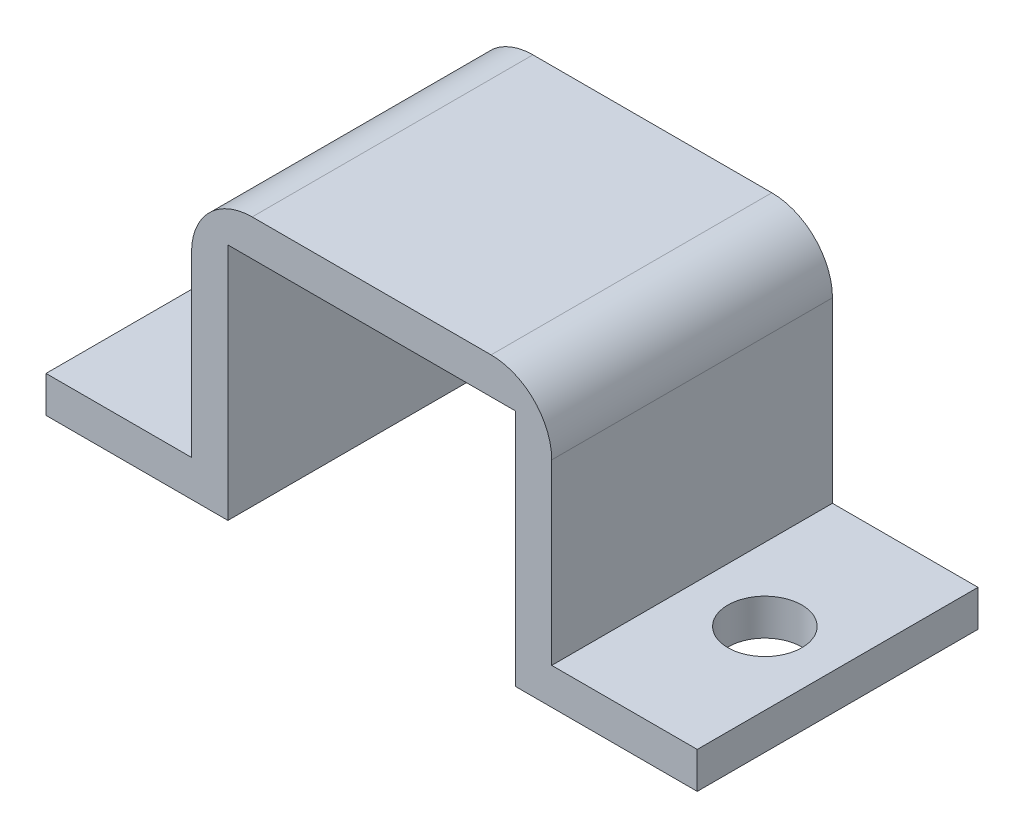
ISO-10303-21;
HEADER;
FILE_DESCRIPTION(('STEP AP214'),'2;1');
FILE_NAME('part.step','',(''),(''),'','','');
FILE_SCHEMA(('AUTOMOTIVE_DESIGN { 1 0 10303 214 1 1 1 1 }'));
ENDSEC;
DATA;
#1=APPLICATION_CONTEXT('core data for automotive mechanical design processes');
#2=APPLICATION_PROTOCOL_DEFINITION('international standard','automotive_design',2000,#1);
#3=PRODUCT_CONTEXT('',#1,'mechanical');
#4=PRODUCT('Part','Part','',(#3));
#5=PRODUCT_RELATED_PRODUCT_CATEGORY('part','',(#4));
#6=PRODUCT_DEFINITION_FORMATION('','',#4);
#7=PRODUCT_DEFINITION_CONTEXT('part definition',#1,'design');
#8=PRODUCT_DEFINITION('design','',#6,#7);
#9=PRODUCT_DEFINITION_SHAPE('','',#8);
#10=(LENGTH_UNIT() NAMED_UNIT(*) SI_UNIT(.MILLI.,.METRE.));
#11=(NAMED_UNIT(*) PLANE_ANGLE_UNIT() SI_UNIT($,.RADIAN.));
#12=(NAMED_UNIT(*) SI_UNIT($,.STERADIAN.) SOLID_ANGLE_UNIT());
#13=UNCERTAINTY_MEASURE_WITH_UNIT(LENGTH_MEASURE(1.E-05),#10,'distance_accuracy_value','');
#14=(GEOMETRIC_REPRESENTATION_CONTEXT(3) GLOBAL_UNCERTAINTY_ASSIGNED_CONTEXT((#13)) GLOBAL_UNIT_ASSIGNED_CONTEXT((#10,
#11,#12)) REPRESENTATION_CONTEXT('',''));
#15=CARTESIAN_POINT('',(0.,0.,0.));
#16=DIRECTION('',(0.,0.,1.));
#17=DIRECTION('',(1.,0.,0.));
#18=AXIS2_PLACEMENT_3D('',#15,#16,#17);
#19=CARTESIAN_POINT('',(0.,1.524,11.7602));
#20=DIRECTION('',(1.,0.,0.));
#21=DIRECTION('',(0.,0.,-1.));
#22=AXIS2_PLACEMENT_3D('',#19,#20,#21);
#23=PLANE('',#22);
#24=DIRECTION('',(0.,-1.,0.));
#25=VECTOR('',#24,1.);
#26=CARTESIAN_POINT('',(0.,1.524,0.));
#27=LINE('',#26,#25);
#28=CARTESIAN_POINT('',(0.,1.524,0.));
#29=VERTEX_POINT('',#28);
#30=CARTESIAN_POINT('',(0.,0.,0.));
#31=VERTEX_POINT('',#30);
#32=EDGE_CURVE('E157',#29,#31,#27,.T.);
#33=ORIENTED_EDGE('',*,*,#32,.T.);
#34=DIRECTION('',(0.,0.,-1.));
#35=VECTOR('',#34,1.);
#36=CARTESIAN_POINT('',(0.,0.,11.7602));
#37=LINE('',#36,#35);
#38=CARTESIAN_POINT('',(0.,0.,11.7602));
#39=VERTEX_POINT('',#38);
#40=EDGE_CURVE('E138',#39,#31,#37,.T.);
#41=ORIENTED_EDGE('',*,*,#40,.F.);
#42=DIRECTION('',(0.,-1.,0.));
#43=VECTOR('',#42,1.);
#44=CARTESIAN_POINT('',(0.,1.524,11.7602));
#45=LINE('',#44,#43);
#46=CARTESIAN_POINT('',(0.,1.524,11.7602));
#47=VERTEX_POINT('',#46);
#48=EDGE_CURVE('E145',#47,#39,#45,.T.);
#49=ORIENTED_EDGE('',*,*,#48,.F.);
#50=DIRECTION('',(0.,0.,-1.));
#51=VECTOR('',#50,1.);
#52=CARTESIAN_POINT('',(0.,1.524,11.7602));
#53=LINE('',#52,#51);
#54=EDGE_CURVE('E194',#47,#29,#53,.T.);
#55=ORIENTED_EDGE('',*,*,#54,.T.);
#56=EDGE_LOOP('',(#33,#41,#49,#55));
#57=FACE_BOUND('',#56,.T.);
#58=ADVANCED_FACE('F33',(#57),#23,.F.);
#59=CARTESIAN_POINT('',(0.,0.,11.7602));
#60=DIRECTION('',(0.,1.,0.));
#61=DIRECTION('',(0.,0.,1.));
#62=AXIS2_PLACEMENT_3D('',#59,#60,#61);
#63=PLANE('',#62);
#64=CARTESIAN_POINT('',(3.048,0.,5.8801));
#65=DIRECTION('',(0.,1.,0.));
#66=DIRECTION('',(0.,0.,1.));
#67=AXIS2_PLACEMENT_3D('',#64,#65,#66);
#68=CIRCLE('',#67,1.55);
#69=CARTESIAN_POINT('',(3.048,0.,7.4301));
#70=VERTEX_POINT('',#69);
#71=EDGE_CURVE('E443',#70,#70,#68,.T.);
#72=ORIENTED_EDGE('',*,*,#71,.T.);
#73=EDGE_LOOP('',(#72));
#74=FACE_BOUND('',#73,.T.);
#75=DIRECTION('',(1.,0.,0.));
#76=VECTOR('',#75,1.);
#77=CARTESIAN_POINT('',(0.,0.,0.));
#78=LINE('',#77,#76);
#79=CARTESIAN_POINT('',(7.62,0.,0.));
#80=VERTEX_POINT('',#79);
#81=EDGE_CURVE('E230',#31,#80,#78,.T.);
#82=ORIENTED_EDGE('',*,*,#81,.T.);
#83=DIRECTION('',(0.,0.,-1.));
#84=VECTOR('',#83,1.);
#85=CARTESIAN_POINT('',(7.62,0.,11.7602));
#86=LINE('',#85,#84);
#87=CARTESIAN_POINT('',(7.62,0.,11.7602));
#88=VERTEX_POINT('',#87);
#89=EDGE_CURVE('E141',#88,#80,#86,.T.);
#90=ORIENTED_EDGE('',*,*,#89,.F.);
#91=DIRECTION('',(1.,0.,0.));
#92=VECTOR('',#91,1.);
#93=CARTESIAN_POINT('',(0.,0.,11.7602));
#94=LINE('',#93,#92);
#95=EDGE_CURVE('E134',#39,#88,#94,.T.);
#96=ORIENTED_EDGE('',*,*,#95,.F.);
#97=ORIENTED_EDGE('',*,*,#40,.T.);
#98=EDGE_LOOP('',(#82,#90,#96,#97));
#99=FACE_BOUND('',#98,.T.);
#100=ADVANCED_FACE('F136',(#74,#99),#63,.F.);
#101=CARTESIAN_POINT('',(7.62,0.,11.7602));
#102=DIRECTION('',(-1.,0.,0.));
#103=DIRECTION('',(0.,0.,1.));
#104=AXIS2_PLACEMENT_3D('',#101,#102,#103);
#105=PLANE('',#104);
#106=DIRECTION('',(0.,1.,0.));
#107=VECTOR('',#106,1.);
#108=CARTESIAN_POINT('',(7.62,0.,0.));
#109=LINE('',#108,#107);
#110=CARTESIAN_POINT('',(7.62,9.9949,0.));
#111=VERTEX_POINT('',#110);
#112=EDGE_CURVE('E224',#80,#111,#109,.T.);
#113=ORIENTED_EDGE('',*,*,#112,.T.);
#114=DIRECTION('',(0.,0.,-1.));
#115=VECTOR('',#114,1.);
#116=CARTESIAN_POINT('',(7.62,9.9949,11.7602));
#117=LINE('',#116,#115);
#118=CARTESIAN_POINT('',(7.62,9.9949,11.7602));
#119=VERTEX_POINT('',#118);
#120=EDGE_CURVE('E163',#119,#111,#117,.T.);
#121=ORIENTED_EDGE('',*,*,#120,.F.);
#122=DIRECTION('',(0.,1.,0.));
#123=VECTOR('',#122,1.);
#124=CARTESIAN_POINT('',(7.62,0.,11.7602));
#125=LINE('',#124,#123);
#126=EDGE_CURVE('E144',#88,#119,#125,.T.);
#127=ORIENTED_EDGE('',*,*,#126,.F.);
#128=ORIENTED_EDGE('',*,*,#89,.T.);
#129=EDGE_LOOP('',(#113,#121,#127,#128));
#130=FACE_BOUND('',#129,.T.);
#131=ADVANCED_FACE('F262',(#130),#105,.F.);
#132=CARTESIAN_POINT('',(7.62,9.9949,11.7602));
#133=DIRECTION('',(0.,1.,0.));
#134=DIRECTION('',(0.,0.,1.));
#135=AXIS2_PLACEMENT_3D('',#132,#133,#134);
#136=PLANE('',#135);
#137=DIRECTION('',(1.,0.,0.));
#138=VECTOR('',#137,1.);
#139=CARTESIAN_POINT('',(7.62,9.9949,0.));
#140=LINE('',#139,#138);
#141=CARTESIAN_POINT('',(19.6596,9.9949,0.));
#142=VERTEX_POINT('',#141);
#143=EDGE_CURVE('E219',#111,#142,#140,.T.);
#144=ORIENTED_EDGE('',*,*,#143,.T.);
#145=DIRECTION('',(0.,0.,-1.));
#146=VECTOR('',#145,1.);
#147=CARTESIAN_POINT('',(19.6596,9.9949,11.7602));
#148=LINE('',#147,#146);
#149=CARTESIAN_POINT('',(19.6596,9.9949,11.7602));
#150=VERTEX_POINT('',#149);
#151=EDGE_CURVE('E210',#150,#142,#148,.T.);
#152=ORIENTED_EDGE('',*,*,#151,.F.);
#153=DIRECTION('',(1.,0.,0.));
#154=VECTOR('',#153,1.);
#155=CARTESIAN_POINT('',(7.62,9.9949,11.7602));
#156=LINE('',#155,#154);
#157=EDGE_CURVE('E220',#119,#150,#156,.T.);
#158=ORIENTED_EDGE('',*,*,#157,.F.);
#159=ORIENTED_EDGE('',*,*,#120,.T.);
#160=EDGE_LOOP('',(#144,#152,#158,#159));
#161=FACE_BOUND('',#160,.T.);
#162=ADVANCED_FACE('F217',(#161),#136,.F.);
#163=CARTESIAN_POINT('',(19.6596,9.9949,11.7602));
#164=DIRECTION('',(1.,0.,0.));
#165=DIRECTION('',(0.,0.,-1.));
#166=AXIS2_PLACEMENT_3D('',#163,#164,#165);
#167=PLANE('',#166);
#168=DIRECTION('',(0.,-1.,0.));
#169=VECTOR('',#168,1.);
#170=CARTESIAN_POINT('',(19.6596,9.9949,0.));
#171=LINE('',#170,#169);
#172=CARTESIAN_POINT('',(19.6596,0.,0.));
#173=VERTEX_POINT('',#172);
#174=EDGE_CURVE('E226',#142,#173,#171,.T.);
#175=ORIENTED_EDGE('',*,*,#174,.T.);
#176=DIRECTION('',(0.,0.,-1.));
#177=VECTOR('',#176,1.);
#178=CARTESIAN_POINT('',(19.6596,0.,11.7602));
#179=LINE('',#178,#177);
#180=CARTESIAN_POINT('',(19.6596,0.,11.7602));
#181=VERTEX_POINT('',#180);
#182=EDGE_CURVE('E207',#181,#173,#179,.T.);
#183=ORIENTED_EDGE('',*,*,#182,.F.);
#184=DIRECTION('',(0.,-1.,0.));
#185=VECTOR('',#184,1.);
#186=CARTESIAN_POINT('',(19.6596,9.9949,11.7602));
#187=LINE('',#186,#185);
#188=EDGE_CURVE('E264',#150,#181,#187,.T.);
#189=ORIENTED_EDGE('',*,*,#188,.F.);
#190=ORIENTED_EDGE('',*,*,#151,.T.);
#191=EDGE_LOOP('',(#175,#183,#189,#190));
#192=FACE_BOUND('',#191,.T.);
#193=ADVANCED_FACE('F286',(#192),#167,.F.);
#194=CARTESIAN_POINT('',(19.6596,0.,11.7602));
#195=DIRECTION('',(0.,1.,0.));
#196=DIRECTION('',(-1.,0.,0.));
#197=AXIS2_PLACEMENT_3D('',#194,#195,#196);
#198=PLANE('',#197);
#199=CARTESIAN_POINT('',(24.2316,0.,5.8801));
#200=DIRECTION('',(0.,1.,0.));
#201=DIRECTION('',(0.,0.,1.));
#202=AXIS2_PLACEMENT_3D('',#199,#200,#201);
#203=CIRCLE('',#202,1.55);
#204=CARTESIAN_POINT('',(24.2316,0.,7.4301));
#205=VERTEX_POINT('',#204);
#206=EDGE_CURVE('E441',#205,#205,#203,.T.);
#207=ORIENTED_EDGE('',*,*,#206,.T.);
#208=EDGE_LOOP('',(#207));
#209=FACE_BOUND('',#208,.T.);
#210=DIRECTION('',(1.,0.,0.));
#211=VECTOR('',#210,1.);
#212=CARTESIAN_POINT('',(19.6596,0.,0.));
#213=LINE('',#212,#211);
#214=CARTESIAN_POINT('',(27.2796,0.,0.));
#215=VERTEX_POINT('',#214);
#216=EDGE_CURVE('E228',#173,#215,#213,.T.);
#217=ORIENTED_EDGE('',*,*,#216,.T.);
#218=DIRECTION('',(0.,0.,-1.));
#219=VECTOR('',#218,1.);
#220=CARTESIAN_POINT('',(27.2796,0.,11.7602));
#221=LINE('',#220,#219);
#222=CARTESIAN_POINT('',(27.2796,0.,11.7602));
#223=VERTEX_POINT('',#222);
#224=EDGE_CURVE('E204',#223,#215,#221,.T.);
#225=ORIENTED_EDGE('',*,*,#224,.F.);
#226=DIRECTION('',(1.,0.,0.));
#227=VECTOR('',#226,1.);
#228=CARTESIAN_POINT('',(19.6596,0.,11.7602));
#229=LINE('',#228,#227);
#230=EDGE_CURVE('E268',#181,#223,#229,.T.);
#231=ORIENTED_EDGE('',*,*,#230,.F.);
#232=ORIENTED_EDGE('',*,*,#182,.T.);
#233=EDGE_LOOP('',(#217,#225,#231,#232));
#234=FACE_BOUND('',#233,.T.);
#235=ADVANCED_FACE('F282',(#209,#234),#198,.F.);
#236=CARTESIAN_POINT('',(27.2796,1.524,11.7602));
#237=DIRECTION('',(-1.,0.,0.));
#238=DIRECTION('',(0.,0.,1.));
#239=AXIS2_PLACEMENT_3D('',#236,#237,#238);
#240=PLANE('',#239);
#241=DIRECTION('',(0.,1.,0.));
#242=VECTOR('',#241,1.);
#243=CARTESIAN_POINT('',(27.2796,1.524,0.));
#244=LINE('',#243,#242);
#245=CARTESIAN_POINT('',(27.2796,1.524,0.));
#246=VERTEX_POINT('',#245);
#247=EDGE_CURVE('E235',#215,#246,#244,.T.);
#248=ORIENTED_EDGE('',*,*,#247,.T.);
#249=DIRECTION('',(0.,0.,-1.));
#250=VECTOR('',#249,1.);
#251=CARTESIAN_POINT('',(27.2796,1.524,11.7602));
#252=LINE('',#251,#250);
#253=CARTESIAN_POINT('',(27.2796,1.524,11.7602));
#254=VERTEX_POINT('',#253);
#255=EDGE_CURVE('E201',#254,#246,#252,.T.);
#256=ORIENTED_EDGE('',*,*,#255,.F.);
#257=DIRECTION('',(0.,1.,0.));
#258=VECTOR('',#257,1.);
#259=CARTESIAN_POINT('',(27.2796,1.524,11.7602));
#260=LINE('',#259,#258);
#261=EDGE_CURVE('E270',#223,#254,#260,.T.);
#262=ORIENTED_EDGE('',*,*,#261,.F.);
#263=ORIENTED_EDGE('',*,*,#224,.T.);
#264=EDGE_LOOP('',(#248,#256,#262,#263));
#265=FACE_BOUND('',#264,.T.);
#266=ADVANCED_FACE('F278',(#265),#240,.F.);
#267=CARTESIAN_POINT('',(21.1836,1.524,11.7602));
#268=DIRECTION('',(0.,-1.,0.));
#269=DIRECTION('',(0.,0.,-1.));
#270=AXIS2_PLACEMENT_3D('',#267,#268,#269);
#271=PLANE('',#270);
#272=CARTESIAN_POINT('',(24.2316,1.524,5.8801));
#273=DIRECTION('',(0.,-1.,0.));
#274=DIRECTION('',(0.,0.,-1.));
#275=AXIS2_PLACEMENT_3D('',#272,#273,#274);
#276=CIRCLE('',#275,1.55);
#277=CARTESIAN_POINT('',(24.2316,1.524,4.3301));
#278=VERTEX_POINT('',#277);
#279=EDGE_CURVE('E438',#278,#278,#276,.T.);
#280=ORIENTED_EDGE('',*,*,#279,.T.);
#281=EDGE_LOOP('',(#280));
#282=FACE_BOUND('',#281,.T.);
#283=DIRECTION('',(-1.,0.,0.));
#284=VECTOR('',#283,1.);
#285=CARTESIAN_POINT('',(21.1836,1.524,0.));
#286=LINE('',#285,#284);
#287=CARTESIAN_POINT('',(21.1836,1.524,0.));
#288=VERTEX_POINT('',#287);
#289=EDGE_CURVE('E237',#246,#288,#286,.T.);
#290=ORIENTED_EDGE('',*,*,#289,.T.);
#291=DIRECTION('',(0.,0.,-1.));
#292=VECTOR('',#291,1.);
#293=CARTESIAN_POINT('',(21.1836,1.524,11.7602));
#294=LINE('',#293,#292);
#295=CARTESIAN_POINT('',(21.1836,1.524,11.7602));
#296=VERTEX_POINT('',#295);
#297=EDGE_CURVE('E198',#296,#288,#294,.T.);
#298=ORIENTED_EDGE('',*,*,#297,.F.);
#299=DIRECTION('',(-1.,0.,0.));
#300=VECTOR('',#299,1.);
#301=CARTESIAN_POINT('',(21.1836,1.524,11.7602));
#302=LINE('',#301,#300);
#303=EDGE_CURVE('E256',#254,#296,#302,.T.);
#304=ORIENTED_EDGE('',*,*,#303,.F.);
#305=ORIENTED_EDGE('',*,*,#255,.T.);
#306=EDGE_LOOP('',(#290,#298,#304,#305));
#307=FACE_BOUND('',#306,.T.);
#308=ADVANCED_FACE('F275',(#282,#307),#271,.F.);
#309=CARTESIAN_POINT('',(21.1836,11.5189,11.7602));
#310=DIRECTION('',(-1.,0.,0.));
#311=DIRECTION('',(0.,0.,1.));
#312=AXIS2_PLACEMENT_3D('',#309,#310,#311);
#313=PLANE('',#312);
#314=DIRECTION('',(0.,1.,0.));
#315=VECTOR('',#314,1.);
#316=CARTESIAN_POINT('',(21.1836,11.5189,0.));
#317=LINE('',#316,#315);
#318=CARTESIAN_POINT('',(21.1836,8.9789,0.));
#319=VERTEX_POINT('',#318);
#320=EDGE_CURVE('E190',#288,#319,#317,.T.);
#321=ORIENTED_EDGE('',*,*,#320,.T.);
#322=DIRECTION('',(0.,0.,-1.));
#323=VECTOR('',#322,1.);
#324=CARTESIAN_POINT('',(21.1836,8.9789,11.7602));
#325=LINE('',#324,#323);
#326=CARTESIAN_POINT('',(21.1836,8.9789,11.7602));
#327=VERTEX_POINT('',#326);
#328=EDGE_CURVE('E168',#319,#327,#325,.F.);
#329=ORIENTED_EDGE('',*,*,#328,.T.);
#330=DIRECTION('',(0.,1.,0.));
#331=VECTOR('',#330,1.);
#332=CARTESIAN_POINT('',(21.1836,11.5189,11.7602));
#333=LINE('',#332,#331);
#334=EDGE_CURVE('E252',#296,#327,#333,.T.);
#335=ORIENTED_EDGE('',*,*,#334,.F.);
#336=ORIENTED_EDGE('',*,*,#297,.T.);
#337=EDGE_LOOP('',(#321,#329,#335,#336));
#338=FACE_BOUND('',#337,.T.);
#339=ADVANCED_FACE('F242',(#338),#313,.F.);
#340=CARTESIAN_POINT('',(6.096,11.5189,11.7602));
#341=DIRECTION('',(0.,-1.,0.));
#342=DIRECTION('',(0.,0.,-1.));
#343=AXIS2_PLACEMENT_3D('',#340,#341,#342);
#344=PLANE('',#343);
#345=DIRECTION('',(-1.,0.,0.));
#346=VECTOR('',#345,1.);
#347=CARTESIAN_POINT('',(6.096,11.5189,0.));
#348=LINE('',#347,#346);
#349=CARTESIAN_POINT('',(18.6436,11.5189,0.));
#350=VERTEX_POINT('',#349);
#351=CARTESIAN_POINT('',(8.636,11.5189,0.));
#352=VERTEX_POINT('',#351);
#353=EDGE_CURVE('E187',#350,#352,#348,.T.);
#354=ORIENTED_EDGE('',*,*,#353,.T.);
#355=DIRECTION('',(0.,0.,-1.));
#356=VECTOR('',#355,1.);
#357=CARTESIAN_POINT('',(8.636,11.5189,11.7602));
#358=LINE('',#357,#356);
#359=CARTESIAN_POINT('',(8.636,11.5189,11.7602));
#360=VERTEX_POINT('',#359);
#361=EDGE_CURVE('E41',#352,#360,#358,.F.);
#362=ORIENTED_EDGE('',*,*,#361,.T.);
#363=DIRECTION('',(-1.,0.,0.));
#364=VECTOR('',#363,1.);
#365=CARTESIAN_POINT('',(6.096,11.5189,11.7602));
#366=LINE('',#365,#364);
#367=CARTESIAN_POINT('',(18.6436,11.5189,11.7602));
#368=VERTEX_POINT('',#367);
#369=EDGE_CURVE('E251',#368,#360,#366,.T.);
#370=ORIENTED_EDGE('',*,*,#369,.F.);
#371=DIRECTION('',(0.,0.,-1.));
#372=VECTOR('',#371,1.);
#373=CARTESIAN_POINT('',(18.6436,11.5189,11.7602));
#374=LINE('',#373,#372);
#375=EDGE_CURVE('E158',#368,#350,#374,.T.);
#376=ORIENTED_EDGE('',*,*,#375,.T.);
#377=EDGE_LOOP('',(#354,#362,#370,#376));
#378=FACE_BOUND('',#377,.T.);
#379=ADVANCED_FACE('F253',(#378),#344,.F.);
#380=CARTESIAN_POINT('',(6.096,1.524,11.7602));
#381=DIRECTION('',(1.,0.,0.));
#382=DIRECTION('',(0.,0.,-1.));
#383=AXIS2_PLACEMENT_3D('',#380,#381,#382);
#384=PLANE('',#383);
#385=DIRECTION('',(0.,-1.,0.));
#386=VECTOR('',#385,1.);
#387=CARTESIAN_POINT('',(6.096,1.524,11.7602));
#388=LINE('',#387,#386);
#389=CARTESIAN_POINT('',(6.096,8.9789,11.7602));
#390=VERTEX_POINT('',#389);
#391=CARTESIAN_POINT('',(6.096,1.524,11.7602));
#392=VERTEX_POINT('',#391);
#393=EDGE_CURVE('E182',#390,#392,#388,.T.);
#394=ORIENTED_EDGE('',*,*,#393,.F.);
#395=DIRECTION('',(0.,0.,-1.));
#396=VECTOR('',#395,1.);
#397=CARTESIAN_POINT('',(6.096,8.9789,11.7602));
#398=LINE('',#397,#396);
#399=CARTESIAN_POINT('',(6.096,8.9789,0.));
#400=VERTEX_POINT('',#399);
#401=EDGE_CURVE('E172',#390,#400,#398,.T.);
#402=ORIENTED_EDGE('',*,*,#401,.T.);
#403=DIRECTION('',(0.,-1.,0.));
#404=VECTOR('',#403,1.);
#405=CARTESIAN_POINT('',(6.096,1.524,0.));
#406=LINE('',#405,#404);
#407=CARTESIAN_POINT('',(6.096,1.524,0.));
#408=VERTEX_POINT('',#407);
#409=EDGE_CURVE('E180',#400,#408,#406,.T.);
#410=ORIENTED_EDGE('',*,*,#409,.T.);
#411=DIRECTION('',(0.,0.,-1.));
#412=VECTOR('',#411,1.);
#413=CARTESIAN_POINT('',(6.096,1.524,11.7602));
#414=LINE('',#413,#412);
#415=EDGE_CURVE('E196',#392,#408,#414,.T.);
#416=ORIENTED_EDGE('',*,*,#415,.F.);
#417=EDGE_LOOP('',(#394,#402,#410,#416));
#418=FACE_BOUND('',#417,.T.);
#419=ADVANCED_FACE('F178',(#418),#384,.F.);
#420=CARTESIAN_POINT('',(0.,1.524,11.7602));
#421=DIRECTION('',(0.,-1.,0.));
#422=DIRECTION('',(0.,0.,-1.));
#423=AXIS2_PLACEMENT_3D('',#420,#421,#422);
#424=PLANE('',#423);
#425=CARTESIAN_POINT('',(3.048,1.524,5.8801));
#426=DIRECTION('',(0.,-1.,0.));
#427=DIRECTION('',(0.,0.,-1.));
#428=AXIS2_PLACEMENT_3D('',#425,#426,#427);
#429=CIRCLE('',#428,1.55);
#430=CARTESIAN_POINT('',(3.048,1.524,4.3301));
#431=VERTEX_POINT('',#430);
#432=EDGE_CURVE('E261',#431,#431,#429,.T.);
#433=ORIENTED_EDGE('',*,*,#432,.T.);
#434=EDGE_LOOP('',(#433));
#435=FACE_BOUND('',#434,.T.);
#436=DIRECTION('',(-1.,0.,0.));
#437=VECTOR('',#436,1.);
#438=CARTESIAN_POINT('',(0.,1.524,0.));
#439=LINE('',#438,#437);
#440=EDGE_CURVE('E154',#408,#29,#439,.T.);
#441=ORIENTED_EDGE('',*,*,#440,.T.);
#442=ORIENTED_EDGE('',*,*,#54,.F.);
#443=DIRECTION('',(-1.,0.,0.));
#444=VECTOR('',#443,1.);
#445=CARTESIAN_POINT('',(0.,1.524,11.7602));
#446=LINE('',#445,#444);
#447=EDGE_CURVE('E150',#392,#47,#446,.T.);
#448=ORIENTED_EDGE('',*,*,#447,.F.);
#449=ORIENTED_EDGE('',*,*,#415,.T.);
#450=EDGE_LOOP('',(#441,#442,#448,#449));
#451=FACE_BOUND('',#450,.T.);
#452=ADVANCED_FACE('F314',(#435,#451),#424,.F.);
#453=CARTESIAN_POINT('',(0.,0.,11.7602));
#454=DIRECTION('',(0.,0.,1.));
#455=DIRECTION('',(1.,0.,0.));
#456=AXIS2_PLACEMENT_3D('',#453,#454,#455);
#457=PLANE('',#456);
#458=ORIENTED_EDGE('',*,*,#369,.T.);
#459=CARTESIAN_POINT('',(8.636,8.9789,11.7602));
#460=DIRECTION('',(0.,0.,1.));
#461=DIRECTION('',(1.,0.,0.));
#462=AXIS2_PLACEMENT_3D('',#459,#460,#461);
#463=CIRCLE('',#462,2.54);
#464=EDGE_CURVE('E11',#360,#390,#463,.T.);
#465=ORIENTED_EDGE('',*,*,#464,.T.);
#466=ORIENTED_EDGE('',*,*,#393,.T.);
#467=ORIENTED_EDGE('',*,*,#447,.T.);
#468=ORIENTED_EDGE('',*,*,#48,.T.);
#469=ORIENTED_EDGE('',*,*,#95,.T.);
#470=ORIENTED_EDGE('',*,*,#126,.T.);
#471=ORIENTED_EDGE('',*,*,#157,.T.);
#472=ORIENTED_EDGE('',*,*,#188,.T.);
#473=ORIENTED_EDGE('',*,*,#230,.T.);
#474=ORIENTED_EDGE('',*,*,#261,.T.);
#475=ORIENTED_EDGE('',*,*,#303,.T.);
#476=ORIENTED_EDGE('',*,*,#334,.T.);
#477=CARTESIAN_POINT('',(18.6436,8.9789,11.7602));
#478=DIRECTION('',(0.,0.,1.));
#479=DIRECTION('',(1.,0.,0.));
#480=AXIS2_PLACEMENT_3D('',#477,#478,#479);
#481=CIRCLE('',#480,2.54);
#482=EDGE_CURVE('E170',#327,#368,#481,.T.);
#483=ORIENTED_EDGE('',*,*,#482,.T.);
#484=EDGE_LOOP('',(#458,#465,#466,#467,#468,#469,#470,#471,#472,#473,#474,#475,#476,#483));
#485=FACE_BOUND('',#484,.T.);
#486=ADVANCED_FACE('F148',(#485),#457,.T.);
#487=CARTESIAN_POINT('',(0.,0.,0.));
#488=DIRECTION('',(0.,0.,1.));
#489=DIRECTION('',(1.,0.,0.));
#490=AXIS2_PLACEMENT_3D('',#487,#488,#489);
#491=PLANE('',#490);
#492=ORIENTED_EDGE('',*,*,#409,.F.);
#493=CARTESIAN_POINT('',(8.636,8.9789,0.));
#494=DIRECTION('',(0.,0.,1.));
#495=DIRECTION('',(1.,0.,0.));
#496=AXIS2_PLACEMENT_3D('',#493,#494,#495);
#497=CIRCLE('',#496,2.54);
#498=EDGE_CURVE('E55',#400,#352,#497,.F.);
#499=ORIENTED_EDGE('',*,*,#498,.T.);
#500=ORIENTED_EDGE('',*,*,#353,.F.);
#501=CARTESIAN_POINT('',(18.6436,8.9789,0.));
#502=DIRECTION('',(0.,0.,1.));
#503=DIRECTION('',(1.,0.,0.));
#504=AXIS2_PLACEMENT_3D('',#501,#502,#503);
#505=CIRCLE('',#504,2.54);
#506=EDGE_CURVE('E161',#350,#319,#505,.F.);
#507=ORIENTED_EDGE('',*,*,#506,.T.);
#508=ORIENTED_EDGE('',*,*,#320,.F.);
#509=ORIENTED_EDGE('',*,*,#289,.F.);
#510=ORIENTED_EDGE('',*,*,#247,.F.);
#511=ORIENTED_EDGE('',*,*,#216,.F.);
#512=ORIENTED_EDGE('',*,*,#174,.F.);
#513=ORIENTED_EDGE('',*,*,#143,.F.);
#514=ORIENTED_EDGE('',*,*,#112,.F.);
#515=ORIENTED_EDGE('',*,*,#81,.F.);
#516=ORIENTED_EDGE('',*,*,#32,.F.);
#517=ORIENTED_EDGE('',*,*,#440,.F.);
#518=EDGE_LOOP('',(#492,#499,#500,#507,#508,#509,#510,#511,#512,#513,#514,#515,#516,#517));
#519=FACE_BOUND('',#518,.T.);
#520=ADVANCED_FACE('F186',(#519),#491,.F.);
#521=CARTESIAN_POINT('',(18.6436,8.9789,11.7602));
#522=DIRECTION('',(0.,0.,-1.));
#523=DIRECTION('',(-1.,0.,0.));
#524=AXIS2_PLACEMENT_3D('',#521,#522,#523);
#525=CYLINDRICAL_SURFACE('',#524,2.54);
#526=ORIENTED_EDGE('',*,*,#482,.F.);
#527=ORIENTED_EDGE('',*,*,#328,.F.);
#528=ORIENTED_EDGE('',*,*,#506,.F.);
#529=ORIENTED_EDGE('',*,*,#375,.F.);
#530=EDGE_LOOP('',(#526,#527,#528,#529));
#531=FACE_BOUND('',#530,.T.);
#532=ADVANCED_FACE('F249',(#531),#525,.T.);
#533=CARTESIAN_POINT('',(8.636,8.9789,11.7602));
#534=DIRECTION('',(0.,0.,-1.));
#535=DIRECTION('',(-1.,0.,0.));
#536=AXIS2_PLACEMENT_3D('',#533,#534,#535);
#537=CYLINDRICAL_SURFACE('',#536,2.54);
#538=ORIENTED_EDGE('',*,*,#464,.F.);
#539=ORIENTED_EDGE('',*,*,#361,.F.);
#540=ORIENTED_EDGE('',*,*,#498,.F.);
#541=ORIENTED_EDGE('',*,*,#401,.F.);
#542=EDGE_LOOP('',(#538,#539,#540,#541));
#543=FACE_BOUND('',#542,.T.);
#544=ADVANCED_FACE('F35',(#543),#537,.T.);
#545=CARTESIAN_POINT('',(3.048,5.9080620433566,5.8801));
#546=DIRECTION('',(0.,-1.,0.));
#547=DIRECTION('',(0.,0.,-1.));
#548=AXIS2_PLACEMENT_3D('',#545,#546,#547);
#549=CYLINDRICAL_SURFACE('',#548,1.55);
#550=ORIENTED_EDGE('',*,*,#432,.F.);
#551=EDGE_LOOP('',(#550));
#552=FACE_BOUND('',#551,.T.);
#553=ORIENTED_EDGE('',*,*,#71,.F.);
#554=EDGE_LOOP('',(#553));
#555=FACE_BOUND('',#554,.T.);
#556=ADVANCED_FACE('F309',(#552,#555),#549,.F.);
#557=CARTESIAN_POINT('',(24.2316,5.9080620433566,5.8801));
#558=DIRECTION('',(0.,-1.,0.));
#559=DIRECTION('',(0.,0.,-1.));
#560=AXIS2_PLACEMENT_3D('',#557,#558,#559);
#561=CYLINDRICAL_SURFACE('',#560,1.55);
#562=ORIENTED_EDGE('',*,*,#279,.F.);
#563=EDGE_LOOP('',(#562));
#564=FACE_BOUND('',#563,.T.);
#565=ORIENTED_EDGE('',*,*,#206,.F.);
#566=EDGE_LOOP('',(#565));
#567=FACE_BOUND('',#566,.T.);
#568=ADVANCED_FACE('F422',(#564,#567),#561,.F.);
#569=CLOSED_SHELL('',(#58,#100,#131,#162,#193,#235,#266,#308,#339,#379,#419,#452,#486,#520,#532,
#544,#556,#568));
#570=MANIFOLD_SOLID_BREP('B2',#569);
#571=ADVANCED_BREP_SHAPE_REPRESENTATION('',(#18,#570),#14);
#572=SHAPE_DEFINITION_REPRESENTATION(#9,#571);
ENDSEC;
END-ISO-10303-21;
